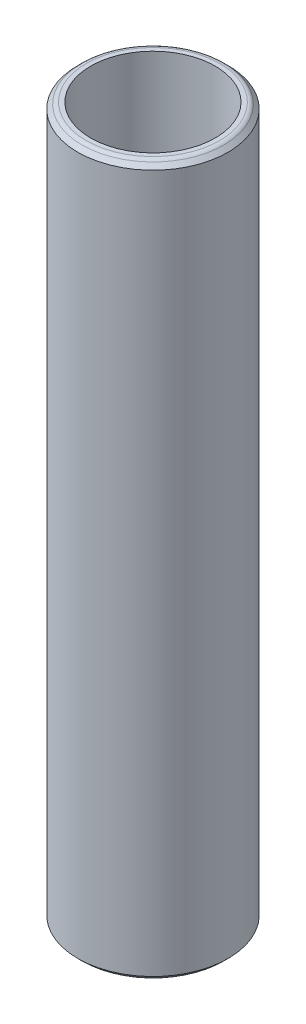
ISO-10303-21;
HEADER;
FILE_DESCRIPTION(('STEP AP214'),'2;1');
FILE_NAME('part.step','',(''),(''),'','','');
FILE_SCHEMA(('AUTOMOTIVE_DESIGN { 1 0 10303 214 1 1 1 1 }'));
ENDSEC;
DATA;
#1=APPLICATION_CONTEXT('core data for automotive mechanical design processes');
#2=APPLICATION_PROTOCOL_DEFINITION('international standard','automotive_design',2000,#1);
#3=PRODUCT_CONTEXT('',#1,'mechanical');
#4=PRODUCT('Part','Part','',(#3));
#5=PRODUCT_RELATED_PRODUCT_CATEGORY('part','',(#4));
#6=PRODUCT_DEFINITION_FORMATION('','',#4);
#7=PRODUCT_DEFINITION_CONTEXT('part definition',#1,'design');
#8=PRODUCT_DEFINITION('design','',#6,#7);
#9=PRODUCT_DEFINITION_SHAPE('','',#8);
#10=(LENGTH_UNIT() NAMED_UNIT(*) SI_UNIT(.MILLI.,.METRE.));
#11=(NAMED_UNIT(*) PLANE_ANGLE_UNIT() SI_UNIT($,.RADIAN.));
#12=(NAMED_UNIT(*) SI_UNIT($,.STERADIAN.) SOLID_ANGLE_UNIT());
#13=UNCERTAINTY_MEASURE_WITH_UNIT(LENGTH_MEASURE(1.E-05),#10,'distance_accuracy_value','');
#14=(GEOMETRIC_REPRESENTATION_CONTEXT(3) GLOBAL_UNCERTAINTY_ASSIGNED_CONTEXT((#13)) GLOBAL_UNIT_ASSIGNED_CONTEXT((#10,
#11,#12)) REPRESENTATION_CONTEXT('',''));
#15=CARTESIAN_POINT('',(0.,0.,0.));
#16=DIRECTION('',(0.,0.,1.));
#17=DIRECTION('',(1.,0.,0.));
#18=AXIS2_PLACEMENT_3D('',#15,#16,#17);
#19=CARTESIAN_POINT('',(0.,30.,0.));
#20=DIRECTION('',(0.,-1.,0.));
#21=DIRECTION('',(0.,0.,-1.));
#22=AXIS2_PLACEMENT_3D('',#19,#20,#21);
#23=CYLINDRICAL_SURFACE('',#22,3.175);
#24=CARTESIAN_POINT('',(0.,0.249999999999997,0.));
#25=DIRECTION('',(0.,1.,0.));
#26=DIRECTION('',(0.,0.,1.));
#27=AXIS2_PLACEMENT_3D('',#24,#25,#26);
#28=CIRCLE('',#27,3.175);
#29=CARTESIAN_POINT('',(0.,0.249999999999997,3.175));
#30=VERTEX_POINT('',#29);
#31=EDGE_CURVE('E55',#30,#30,#28,.T.);
#32=ORIENTED_EDGE('',*,*,#31,.T.);
#33=EDGE_LOOP('',(#32));
#34=FACE_BOUND('',#33,.T.);
#35=CARTESIAN_POINT('',(0.,29.75,0.));
#36=DIRECTION('',(0.,1.,0.));
#37=DIRECTION('',(0.,0.,1.));
#38=AXIS2_PLACEMENT_3D('',#35,#36,#37);
#39=CIRCLE('',#38,3.175);
#40=CARTESIAN_POINT('',(0.,29.75,3.175));
#41=VERTEX_POINT('',#40);
#42=EDGE_CURVE('E58',#41,#41,#39,.F.);
#43=ORIENTED_EDGE('',*,*,#42,.T.);
#44=EDGE_LOOP('',(#43));
#45=FACE_BOUND('',#44,.T.);
#46=ADVANCED_FACE('F35',(#34,#45),#23,.T.);
#47=CARTESIAN_POINT('',(0.,30.,0.));
#48=DIRECTION('',(0.,1.,0.));
#49=DIRECTION('',(0.,0.,1.));
#50=AXIS2_PLACEMENT_3D('',#47,#48,#49);
#51=PLANE('',#50);
#52=CARTESIAN_POINT('',(0.,30.,0.));
#53=DIRECTION('',(0.,1.,0.));
#54=DIRECTION('',(0.,0.,1.));
#55=AXIS2_PLACEMENT_3D('',#52,#53,#54);
#56=CIRCLE('',#55,2.82144660940672);
#57=CARTESIAN_POINT('',(0.,30.,2.82144660940672));
#58=VERTEX_POINT('',#57);
#59=EDGE_CURVE('E50',#58,#58,#56,.T.);
#60=ORIENTED_EDGE('',*,*,#59,.T.);
#61=EDGE_LOOP('',(#60));
#62=FACE_BOUND('',#61,.T.);
#63=CARTESIAN_POINT('',(0.,30.,0.));
#64=DIRECTION('',(0.,1.,0.));
#65=DIRECTION('',(0.,0.,1.));
#66=AXIS2_PLACEMENT_3D('',#63,#64,#65);
#67=CIRCLE('',#66,2.63268459235178);
#68=CARTESIAN_POINT('',(0.,30.,2.63268459235178));
#69=VERTEX_POINT('',#68);
#70=EDGE_CURVE('E61',#69,#69,#67,.F.);
#71=ORIENTED_EDGE('',*,*,#70,.T.);
#72=EDGE_LOOP('',(#71));
#73=FACE_BOUND('',#72,.T.);
#74=ADVANCED_FACE('F86',(#62,#73),#51,.T.);
#75=CARTESIAN_POINT('',(0.,0.,0.));
#76=DIRECTION('',(0.,1.,0.));
#77=DIRECTION('',(0.,0.,1.));
#78=AXIS2_PLACEMENT_3D('',#75,#76,#77);
#79=PLANE('',#78);
#80=CARTESIAN_POINT('',(0.,0.,0.));
#81=DIRECTION('',(0.,1.,0.));
#82=DIRECTION('',(0.,0.,1.));
#83=AXIS2_PLACEMENT_3D('',#80,#81,#82);
#84=CIRCLE('',#83,2.82144660940673);
#85=CARTESIAN_POINT('',(0.,0.,2.82144660940673));
#86=VERTEX_POINT('',#85);
#87=EDGE_CURVE('E42',#86,#86,#84,.F.);
#88=ORIENTED_EDGE('',*,*,#87,.T.);
#89=EDGE_LOOP('',(#88));
#90=FACE_BOUND('',#89,.T.);
#91=CARTESIAN_POINT('',(0.,0.,0.));
#92=DIRECTION('',(0.,1.,0.));
#93=DIRECTION('',(0.,0.,1.));
#94=AXIS2_PLACEMENT_3D('',#91,#92,#93);
#95=CIRCLE('',#94,2.63268459235178);
#96=CARTESIAN_POINT('',(0.,0.,2.63268459235178));
#97=VERTEX_POINT('',#96);
#98=EDGE_CURVE('E64',#97,#97,#95,.T.);
#99=ORIENTED_EDGE('',*,*,#98,.T.);
#100=EDGE_LOOP('',(#99));
#101=FACE_BOUND('',#100,.T.);
#102=ADVANCED_FACE('F68',(#90,#101),#79,.F.);
#103=CARTESIAN_POINT('',(0.,30.,0.));
#104=DIRECTION('',(0.,-1.,0.));
#105=DIRECTION('',(0.,0.,-1.));
#106=AXIS2_PLACEMENT_3D('',#103,#104,#105);
#107=CONICAL_SURFACE('',#106,2.925,0.785398163397455);
#108=CARTESIAN_POINT('',(0.,29.9267766952966,0.));
#109=DIRECTION('',(0.,1.,0.));
#110=DIRECTION('',(0.,0.,1.));
#111=AXIS2_PLACEMENT_3D('',#108,#109,#110);
#112=CIRCLE('',#111,2.99822330470336);
#113=CARTESIAN_POINT('',(0.,29.9267766952966,2.99822330470336));
#114=VERTEX_POINT('',#113);
#115=EDGE_CURVE('E46',#114,#114,#112,.F.);
#116=ORIENTED_EDGE('',*,*,#115,.T.);
#117=EDGE_LOOP('',(#116));
#118=FACE_BOUND('',#117,.T.);
#119=ORIENTED_EDGE('',*,*,#42,.F.);
#120=EDGE_LOOP('',(#119));
#121=FACE_BOUND('',#120,.T.);
#122=ADVANCED_FACE('F81',(#118,#121),#107,.T.);
#123=CARTESIAN_POINT('',(0.,0.249999999999997,0.));
#124=DIRECTION('',(0.,1.,0.));
#125=DIRECTION('',(0.,0.,1.));
#126=AXIS2_PLACEMENT_3D('',#123,#124,#125);
#127=CONICAL_SURFACE('',#126,3.175,0.78539816339745);
#128=CARTESIAN_POINT('',(0.,0.0732233047033627,0.));
#129=DIRECTION('',(0.,1.,0.));
#130=DIRECTION('',(0.,0.,1.));
#131=AXIS2_PLACEMENT_3D('',#128,#129,#130);
#132=CIRCLE('',#131,2.99822330470337);
#133=CARTESIAN_POINT('',(0.,0.0732233047033627,2.99822330470337));
#134=VERTEX_POINT('',#133);
#135=EDGE_CURVE('E10',#134,#134,#132,.T.);
#136=ORIENTED_EDGE('',*,*,#135,.T.);
#137=EDGE_LOOP('',(#136));
#138=FACE_BOUND('',#137,.T.);
#139=ORIENTED_EDGE('',*,*,#31,.F.);
#140=EDGE_LOOP('',(#139));
#141=FACE_BOUND('',#140,.T.);
#142=ADVANCED_FACE('F73',(#138,#141),#127,.T.);
#143=CARTESIAN_POINT('',(0.,34.,0.));
#144=DIRECTION('',(0.,-1.,0.));
#145=DIRECTION('',(0.,0.,-1.));
#146=AXIS2_PLACEMENT_3D('',#143,#144,#145);
#147=CYLINDRICAL_SURFACE('',#146,2.63268459235178);
#148=ORIENTED_EDGE('',*,*,#70,.F.);
#149=EDGE_LOOP('',(#148));
#150=FACE_BOUND('',#149,.T.);
#151=ORIENTED_EDGE('',*,*,#98,.F.);
#152=EDGE_LOOP('',(#151));
#153=FACE_BOUND('',#152,.T.);
#154=ADVANCED_FACE('F70',(#150,#153),#147,.F.);
#155=CARTESIAN_POINT('',(0.,29.75,0.));
#156=DIRECTION('',(0.,1.,0.));
#157=DIRECTION('',(0.,0.,1.));
#158=AXIS2_PLACEMENT_3D('',#155,#156,#157);
#159=TOROIDAL_SURFACE('',#158,2.82144660940672,0.25);
#160=ORIENTED_EDGE('',*,*,#115,.F.);
#161=EDGE_LOOP('',(#160));
#162=FACE_BOUND('',#161,.T.);
#163=ORIENTED_EDGE('',*,*,#59,.F.);
#164=EDGE_LOOP('',(#163));
#165=FACE_BOUND('',#164,.T.);
#166=ADVANCED_FACE('F72',(#162,#165),#159,.T.);
#167=CARTESIAN_POINT('',(0.,0.25,0.));
#168=DIRECTION('',(0.,1.,0.));
#169=DIRECTION('',(0.,0.,1.));
#170=AXIS2_PLACEMENT_3D('',#167,#168,#169);
#171=TOROIDAL_SURFACE('',#170,2.82144660940673,0.25);
#172=ORIENTED_EDGE('',*,*,#135,.F.);
#173=EDGE_LOOP('',(#172));
#174=FACE_BOUND('',#173,.T.);
#175=ORIENTED_EDGE('',*,*,#87,.F.);
#176=EDGE_LOOP('',(#175));
#177=FACE_BOUND('',#176,.T.);
#178=ADVANCED_FACE('F37',(#174,#177),#171,.T.);
#179=CLOSED_SHELL('',(#46,#74,#102,#122,#142,#154,#166,#178));
#180=MANIFOLD_SOLID_BREP('B2',#179);
#181=ADVANCED_BREP_SHAPE_REPRESENTATION('',(#18,#180),#14);
#182=SHAPE_DEFINITION_REPRESENTATION(#9,#181);
ENDSEC;
END-ISO-10303-21;
